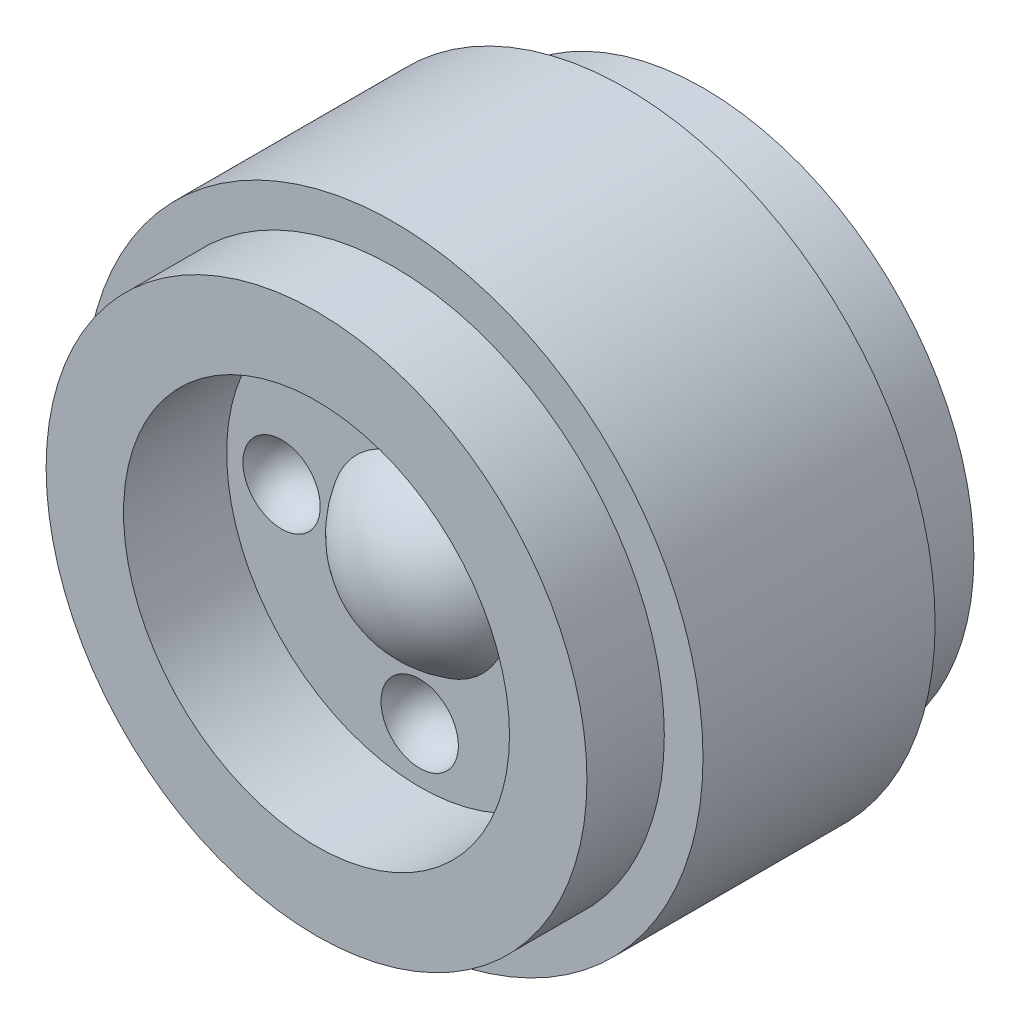
ISO-10303-21;
HEADER;
FILE_DESCRIPTION(('STEP AP214'),'2;1');
FILE_NAME('part.step','',(''),(''),'','','');
FILE_SCHEMA(('AUTOMOTIVE_DESIGN { 1 0 10303 214 1 1 1 1 }'));
ENDSEC;
DATA;
#1=APPLICATION_CONTEXT('core data for automotive mechanical design processes');
#2=APPLICATION_PROTOCOL_DEFINITION('international standard','automotive_design',2000,#1);
#3=PRODUCT_CONTEXT('',#1,'mechanical');
#4=PRODUCT('Part','Part','',(#3));
#5=PRODUCT_RELATED_PRODUCT_CATEGORY('part','',(#4));
#6=PRODUCT_DEFINITION_FORMATION('','',#4);
#7=PRODUCT_DEFINITION_CONTEXT('part definition',#1,'design');
#8=PRODUCT_DEFINITION('design','',#6,#7);
#9=PRODUCT_DEFINITION_SHAPE('','',#8);
#10=(LENGTH_UNIT() NAMED_UNIT(*) SI_UNIT(.MILLI.,.METRE.));
#11=(NAMED_UNIT(*) PLANE_ANGLE_UNIT() SI_UNIT($,.RADIAN.));
#12=(NAMED_UNIT(*) SI_UNIT($,.STERADIAN.) SOLID_ANGLE_UNIT());
#13=UNCERTAINTY_MEASURE_WITH_UNIT(LENGTH_MEASURE(1.E-05),#10,'distance_accuracy_value','');
#14=(GEOMETRIC_REPRESENTATION_CONTEXT(3) GLOBAL_UNCERTAINTY_ASSIGNED_CONTEXT((#13)) GLOBAL_UNIT_ASSIGNED_CONTEXT((#10,
#11,#12)) REPRESENTATION_CONTEXT('',''));
#15=CARTESIAN_POINT('',(0.,0.,0.));
#16=DIRECTION('',(0.,0.,1.));
#17=DIRECTION('',(1.,0.,0.));
#18=AXIS2_PLACEMENT_3D('',#15,#16,#17);
#19=CARTESIAN_POINT('',(0.,6.03504,2.82448));
#20=DIRECTION('',(0.,0.,-1.));
#21=DIRECTION('',(-1.,0.,0.));
#22=AXIS2_PLACEMENT_3D('',#19,#20,#21);
#23=PLANE('',#22);
#24=CARTESIAN_POINT('',(0.,-4.318,2.82448));
#25=DIRECTION('',(0.,0.,-1.));
#26=DIRECTION('',(-1.,0.,0.));
#27=AXIS2_PLACEMENT_3D('',#24,#25,#26);
#28=CIRCLE('',#27,1.20904);
#29=CARTESIAN_POINT('',(-1.20904,-4.318,2.82448));
#30=VERTEX_POINT('',#29);
#31=EDGE_CURVE('E53',#30,#30,#28,.F.);
#32=ORIENTED_EDGE('',*,*,#31,.F.);
#33=EDGE_LOOP('',(#32));
#34=FACE_BOUND('',#33,.T.);
#35=CARTESIAN_POINT('',(0.,4.318,2.82448));
#36=DIRECTION('',(0.,0.,-1.));
#37=DIRECTION('',(-1.,0.,0.));
#38=AXIS2_PLACEMENT_3D('',#35,#36,#37);
#39=CIRCLE('',#38,1.20904);
#40=CARTESIAN_POINT('',(-1.20904,4.318,2.82448));
#41=VERTEX_POINT('',#40);
#42=EDGE_CURVE('E47',#41,#41,#39,.F.);
#43=ORIENTED_EDGE('',*,*,#42,.F.);
#44=EDGE_LOOP('',(#43));
#45=FACE_BOUND('',#44,.T.);
#46=CARTESIAN_POINT('',(0.,0.,2.82448));
#47=DIRECTION('',(0.,0.,1.));
#48=DIRECTION('',(1.,0.,0.));
#49=AXIS2_PLACEMENT_3D('',#46,#47,#48);
#50=CIRCLE('',#49,2.79215673743434);
#51=CARTESIAN_POINT('',(2.79215673743434,0.,2.82448));
#52=VERTEX_POINT('',#51);
#53=EDGE_CURVE('E50',#52,#52,#50,.T.);
#54=ORIENTED_EDGE('',*,*,#53,.F.);
#55=EDGE_LOOP('',(#54));
#56=FACE_BOUND('',#55,.T.);
#57=CARTESIAN_POINT('',(0.,0.,2.82448));
#58=DIRECTION('',(0.,0.,1.));
#59=DIRECTION('',(1.,0.,0.));
#60=AXIS2_PLACEMENT_3D('',#57,#58,#59);
#61=CIRCLE('',#60,6.03504);
#62=CARTESIAN_POINT('',(6.03504,0.,2.82448));
#63=VERTEX_POINT('',#62);
#64=EDGE_CURVE('E225',#63,#63,#61,.T.);
#65=ORIENTED_EDGE('',*,*,#64,.T.);
#66=EDGE_LOOP('',(#65));
#67=FACE_BOUND('',#66,.T.);
#68=CARTESIAN_POINT('',(-4.318,0.,2.82448));
#69=DIRECTION('',(0.,0.,-1.));
#70=DIRECTION('',(-1.,0.,0.));
#71=AXIS2_PLACEMENT_3D('',#68,#69,#70);
#72=CIRCLE('',#71,1.20904);
#73=CARTESIAN_POINT('',(-5.52704,0.,2.82448));
#74=VERTEX_POINT('',#73);
#75=EDGE_CURVE('E51',#74,#74,#72,.F.);
#76=ORIENTED_EDGE('',*,*,#75,.F.);
#77=EDGE_LOOP('',(#76));
#78=FACE_BOUND('',#77,.T.);
#79=CARTESIAN_POINT('',(4.318,0.,2.82448));
#80=DIRECTION('',(0.,0.,-1.));
#81=DIRECTION('',(-1.,0.,0.));
#82=AXIS2_PLACEMENT_3D('',#79,#80,#81);
#83=CIRCLE('',#82,1.20904);
#84=CARTESIAN_POINT('',(3.10896,0.,2.82448));
#85=VERTEX_POINT('',#84);
#86=EDGE_CURVE('E34',#85,#85,#83,.F.);
#87=ORIENTED_EDGE('',*,*,#86,.F.);
#88=EDGE_LOOP('',(#87));
#89=FACE_BOUND('',#88,.T.);
#90=ADVANCED_FACE('F30',(#34,#45,#56,#67,#78,#89),#23,.F.);
#91=CARTESIAN_POINT('',(0.,0.,1.20904));
#92=DIRECTION('',(0.,0.,1.));
#93=DIRECTION('',(0.,1.,0.));
#94=AXIS2_PLACEMENT_3D('',#91,#92,#93);
#95=SPHERICAL_SURFACE('',#94,3.2258);
#96=ORIENTED_EDGE('',*,*,#53,.T.);
#97=EDGE_LOOP('',(#96));
#98=FACE_BOUND('',#97,.T.);
#99=ADVANCED_FACE('F32',(#98),#95,.T.);
#100=CARTESIAN_POINT('',(0.,3.2258,-1.61544));
#101=DIRECTION('',(0.,0.,1.));
#102=DIRECTION('',(1.,0.,0.));
#103=AXIS2_PLACEMENT_3D('',#100,#101,#102);
#104=PLANE('',#103);
#105=CARTESIAN_POINT('',(0.,0.,-1.61544));
#106=DIRECTION('',(0.,0.,1.));
#107=DIRECTION('',(1.,0.,0.));
#108=AXIS2_PLACEMENT_3D('',#105,#106,#107);
#109=CIRCLE('',#108,3.2258);
#110=CARTESIAN_POINT('',(3.2258,0.,-1.61544));
#111=VERTEX_POINT('',#110);
#112=EDGE_CURVE('E10',#111,#111,#109,.T.);
#113=ORIENTED_EDGE('',*,*,#112,.F.);
#114=EDGE_LOOP('',(#113));
#115=FACE_BOUND('',#114,.T.);
#116=ADVANCED_FACE('F68',(#115),#104,.F.);
#117=CARTESIAN_POINT('',(0.,0.,4.43484));
#118=DIRECTION('',(0.,0.,1.));
#119=DIRECTION('',(1.,0.,0.));
#120=AXIS2_PLACEMENT_3D('',#117,#118,#119);
#121=CYLINDRICAL_SURFACE('',#120,3.2258);
#122=CARTESIAN_POINT('',(0.,0.,-6.05028));
#123=DIRECTION('',(0.,0.,1.));
#124=DIRECTION('',(1.,0.,0.));
#125=AXIS2_PLACEMENT_3D('',#122,#123,#124);
#126=CIRCLE('',#125,3.2258);
#127=CARTESIAN_POINT('',(3.2258,0.,-6.05028));
#128=VERTEX_POINT('',#127);
#129=EDGE_CURVE('E38',#128,#128,#126,.T.);
#130=ORIENTED_EDGE('',*,*,#129,.F.);
#131=EDGE_LOOP('',(#130));
#132=FACE_BOUND('',#131,.T.);
#133=ORIENTED_EDGE('',*,*,#112,.T.);
#134=EDGE_LOOP('',(#133));
#135=FACE_BOUND('',#134,.T.);
#136=ADVANCED_FACE('F106',(#132,#135),#121,.F.);
#137=CARTESIAN_POINT('',(0.,3.2258,-6.05028));
#138=DIRECTION('',(0.,0.,1.));
#139=DIRECTION('',(1.,0.,0.));
#140=AXIS2_PLACEMENT_3D('',#137,#138,#139);
#141=PLANE('',#140);
#142=CARTESIAN_POINT('',(0.,0.,-6.05028));
#143=DIRECTION('',(0.,0.,1.));
#144=DIRECTION('',(1.,0.,0.));
#145=AXIS2_PLACEMENT_3D('',#142,#143,#144);
#146=CIRCLE('',#145,8.45566);
#147=CARTESIAN_POINT('',(8.45566,0.,-6.05028));
#148=VERTEX_POINT('',#147);
#149=EDGE_CURVE('E43',#148,#148,#146,.T.);
#150=ORIENTED_EDGE('',*,*,#149,.F.);
#151=EDGE_LOOP('',(#150));
#152=FACE_BOUND('',#151,.T.);
#153=ORIENTED_EDGE('',*,*,#129,.T.);
#154=EDGE_LOOP('',(#153));
#155=FACE_BOUND('',#154,.T.);
#156=ADVANCED_FACE('F102',(#152,#155),#141,.F.);
#157=CARTESIAN_POINT('',(0.,0.,4.43484));
#158=DIRECTION('',(0.,0.,1.));
#159=DIRECTION('',(1.,0.,0.));
#160=AXIS2_PLACEMENT_3D('',#157,#158,#159);
#161=CYLINDRICAL_SURFACE('',#160,8.45566);
#162=CARTESIAN_POINT('',(0.,0.,-3.62966));
#163=DIRECTION('',(0.,0.,1.));
#164=DIRECTION('',(1.,0.,0.));
#165=AXIS2_PLACEMENT_3D('',#162,#163,#164);
#166=CIRCLE('',#165,8.45566);
#167=CARTESIAN_POINT('',(8.45566,0.,-3.62966));
#168=VERTEX_POINT('',#167);
#169=EDGE_CURVE('E244',#168,#168,#166,.T.);
#170=ORIENTED_EDGE('',*,*,#169,.F.);
#171=EDGE_LOOP('',(#170));
#172=FACE_BOUND('',#171,.T.);
#173=ORIENTED_EDGE('',*,*,#149,.T.);
#174=EDGE_LOOP('',(#173));
#175=FACE_BOUND('',#174,.T.);
#176=ADVANCED_FACE('F98',(#172,#175),#161,.T.);
#177=CARTESIAN_POINT('',(0.,9.6647,-3.62966));
#178=DIRECTION('',(0.,0.,1.));
#179=DIRECTION('',(1.,0.,0.));
#180=AXIS2_PLACEMENT_3D('',#177,#178,#179);
#181=PLANE('',#180);
#182=CARTESIAN_POINT('',(0.,0.,-3.62966));
#183=DIRECTION('',(0.,0.,1.));
#184=DIRECTION('',(1.,0.,0.));
#185=AXIS2_PLACEMENT_3D('',#182,#183,#184);
#186=CIRCLE('',#185,9.6647);
#187=CARTESIAN_POINT('',(9.6647,0.,-3.62966));
#188=VERTEX_POINT('',#187);
#189=EDGE_CURVE('E241',#188,#188,#186,.T.);
#190=ORIENTED_EDGE('',*,*,#189,.F.);
#191=EDGE_LOOP('',(#190));
#192=FACE_BOUND('',#191,.T.);
#193=ORIENTED_EDGE('',*,*,#169,.T.);
#194=EDGE_LOOP('',(#193));
#195=FACE_BOUND('',#194,.T.);
#196=ADVANCED_FACE('F94',(#192,#195),#181,.F.);
#197=CARTESIAN_POINT('',(0.,0.,4.43484));
#198=DIRECTION('',(0.,0.,1.));
#199=DIRECTION('',(1.,0.,0.));
#200=AXIS2_PLACEMENT_3D('',#197,#198,#199);
#201=CYLINDRICAL_SURFACE('',#200,9.6647);
#202=CARTESIAN_POINT('',(0.,0.,3.62966));
#203=DIRECTION('',(0.,0.,1.));
#204=DIRECTION('',(1.,0.,0.));
#205=AXIS2_PLACEMENT_3D('',#202,#203,#204);
#206=CIRCLE('',#205,9.6647);
#207=CARTESIAN_POINT('',(9.6647,0.,3.62966));
#208=VERTEX_POINT('',#207);
#209=EDGE_CURVE('E238',#208,#208,#206,.T.);
#210=ORIENTED_EDGE('',*,*,#209,.F.);
#211=EDGE_LOOP('',(#210));
#212=FACE_BOUND('',#211,.T.);
#213=ORIENTED_EDGE('',*,*,#189,.T.);
#214=EDGE_LOOP('',(#213));
#215=FACE_BOUND('',#214,.T.);
#216=ADVANCED_FACE('F90',(#212,#215),#201,.T.);
#217=CARTESIAN_POINT('',(0.,9.6647,3.62966));
#218=DIRECTION('',(0.,0.,-1.));
#219=DIRECTION('',(-1.,0.,0.));
#220=AXIS2_PLACEMENT_3D('',#217,#218,#219);
#221=PLANE('',#220);
#222=CARTESIAN_POINT('',(0.,0.,3.62966));
#223=DIRECTION('',(0.,0.,1.));
#224=DIRECTION('',(1.,0.,0.));
#225=AXIS2_PLACEMENT_3D('',#222,#223,#224);
#226=CIRCLE('',#225,8.45566);
#227=CARTESIAN_POINT('',(8.45566,0.,3.62966));
#228=VERTEX_POINT('',#227);
#229=EDGE_CURVE('E235',#228,#228,#226,.T.);
#230=ORIENTED_EDGE('',*,*,#229,.F.);
#231=EDGE_LOOP('',(#230));
#232=FACE_BOUND('',#231,.T.);
#233=ORIENTED_EDGE('',*,*,#209,.T.);
#234=EDGE_LOOP('',(#233));
#235=FACE_BOUND('',#234,.T.);
#236=ADVANCED_FACE('F86',(#232,#235),#221,.F.);
#237=CARTESIAN_POINT('',(0.,0.,4.43484));
#238=DIRECTION('',(0.,0.,1.));
#239=DIRECTION('',(1.,0.,0.));
#240=AXIS2_PLACEMENT_3D('',#237,#238,#239);
#241=CYLINDRICAL_SURFACE('',#240,8.45566);
#242=CARTESIAN_POINT('',(0.,0.,6.05028));
#243=DIRECTION('',(0.,0.,1.));
#244=DIRECTION('',(1.,0.,0.));
#245=AXIS2_PLACEMENT_3D('',#242,#243,#244);
#246=CIRCLE('',#245,8.45566);
#247=CARTESIAN_POINT('',(8.45566,0.,6.05028));
#248=VERTEX_POINT('',#247);
#249=EDGE_CURVE('E229',#248,#248,#246,.T.);
#250=ORIENTED_EDGE('',*,*,#249,.F.);
#251=EDGE_LOOP('',(#250));
#252=FACE_BOUND('',#251,.T.);
#253=ORIENTED_EDGE('',*,*,#229,.T.);
#254=EDGE_LOOP('',(#253));
#255=FACE_BOUND('',#254,.T.);
#256=ADVANCED_FACE('F82',(#252,#255),#241,.T.);
#257=CARTESIAN_POINT('',(0.,8.45566,6.05028));
#258=DIRECTION('',(0.,0.,-1.));
#259=DIRECTION('',(-1.,0.,0.));
#260=AXIS2_PLACEMENT_3D('',#257,#258,#259);
#261=PLANE('',#260);
#262=CARTESIAN_POINT('',(0.,0.,6.05028));
#263=DIRECTION('',(0.,0.,1.));
#264=DIRECTION('',(1.,0.,0.));
#265=AXIS2_PLACEMENT_3D('',#262,#263,#264);
#266=CIRCLE('',#265,6.03504);
#267=CARTESIAN_POINT('',(6.03504,0.,6.05028));
#268=VERTEX_POINT('',#267);
#269=EDGE_CURVE('E226',#268,#268,#266,.T.);
#270=ORIENTED_EDGE('',*,*,#269,.F.);
#271=EDGE_LOOP('',(#270));
#272=FACE_BOUND('',#271,.T.);
#273=ORIENTED_EDGE('',*,*,#249,.T.);
#274=EDGE_LOOP('',(#273));
#275=FACE_BOUND('',#274,.T.);
#276=ADVANCED_FACE('F78',(#272,#275),#261,.F.);
#277=CARTESIAN_POINT('',(0.,0.,4.43484));
#278=DIRECTION('',(0.,0.,1.));
#279=DIRECTION('',(1.,0.,0.));
#280=AXIS2_PLACEMENT_3D('',#277,#278,#279);
#281=CYLINDRICAL_SURFACE('',#280,6.03504);
#282=ORIENTED_EDGE('',*,*,#64,.F.);
#283=EDGE_LOOP('',(#282));
#284=FACE_BOUND('',#283,.T.);
#285=ORIENTED_EDGE('',*,*,#269,.T.);
#286=EDGE_LOOP('',(#285));
#287=FACE_BOUND('',#286,.T.);
#288=ADVANCED_FACE('F75',(#284,#287),#281,.F.);
#289=CARTESIAN_POINT('',(0.,4.318,2.82448));
#290=DIRECTION('',(-1.,0.,0.));
#291=DIRECTION('',(0.,1.,0.));
#292=AXIS2_PLACEMENT_3D('',#289,#290,#291);
#293=SPHERICAL_SURFACE('',#292,1.20904);
#294=CARTESIAN_POINT('',(0.,4.318,2.82448));
#295=DIRECTION('',(0.,0.,-1.));
#296=DIRECTION('',(-1.,0.,0.));
#297=AXIS2_PLACEMENT_3D('',#294,#295,#296);
#298=SPHERICAL_SURFACE('',#297,1.20904);
#299=ORIENTED_EDGE('',*,*,#42,.T.);
#300=EDGE_LOOP('',(#299));
#301=FACE_BOUND('',#300,.T.);
#302=ADVANCED_FACE('F73',(#301),#298,.F.);
#303=CARTESIAN_POINT('',(-4.318,0.,2.82448));
#304=DIRECTION('',(0.,-1.,0.));
#305=DIRECTION('',(-1.,0.,0.));
#306=AXIS2_PLACEMENT_3D('',#303,#304,#305);
#307=SPHERICAL_SURFACE('',#306,1.20904);
#308=CARTESIAN_POINT('',(-4.318,0.,2.82448));
#309=DIRECTION('',(0.,0.,-1.));
#310=DIRECTION('',(-1.,0.,0.));
#311=AXIS2_PLACEMENT_3D('',#308,#309,#310);
#312=SPHERICAL_SURFACE('',#311,1.20904);
#313=ORIENTED_EDGE('',*,*,#75,.T.);
#314=EDGE_LOOP('',(#313));
#315=FACE_BOUND('',#314,.T.);
#316=ADVANCED_FACE('F158',(#315),#312,.F.);
#317=CARTESIAN_POINT('',(0.,-4.318,2.82448));
#318=DIRECTION('',(1.,0.,0.));
#319=DIRECTION('',(0.,-1.,0.));
#320=AXIS2_PLACEMENT_3D('',#317,#318,#319);
#321=SPHERICAL_SURFACE('',#320,1.20904);
#322=CARTESIAN_POINT('',(0.,-4.318,2.82448));
#323=DIRECTION('',(0.,0.,-1.));
#324=DIRECTION('',(-1.,0.,0.));
#325=AXIS2_PLACEMENT_3D('',#322,#323,#324);
#326=SPHERICAL_SURFACE('',#325,1.20904);
#327=ORIENTED_EDGE('',*,*,#31,.T.);
#328=EDGE_LOOP('',(#327));
#329=FACE_BOUND('',#328,.T.);
#330=ADVANCED_FACE('F165',(#329),#326,.F.);
#331=CARTESIAN_POINT('',(4.318,0.,2.82448));
#332=DIRECTION('',(0.,1.,0.));
#333=DIRECTION('',(1.,0.,0.));
#334=AXIS2_PLACEMENT_3D('',#331,#332,#333);
#335=SPHERICAL_SURFACE('',#334,1.20904);
#336=CARTESIAN_POINT('',(4.318,0.,2.82448));
#337=DIRECTION('',(0.,0.,-1.));
#338=DIRECTION('',(-1.,0.,0.));
#339=AXIS2_PLACEMENT_3D('',#336,#337,#338);
#340=SPHERICAL_SURFACE('',#339,1.20904);
#341=ORIENTED_EDGE('',*,*,#86,.T.);
#342=EDGE_LOOP('',(#341));
#343=FACE_BOUND('',#342,.T.);
#344=ADVANCED_FACE('F60',(#343),#340,.F.);
#345=CLOSED_SHELL('',(#90,#99,#116,#136,#156,#176,#196,#216,#236,#256,#276,#288,#302,#316,#330,#344));
#346=MANIFOLD_SOLID_BREP('B2',#345);
#347=ADVANCED_BREP_SHAPE_REPRESENTATION('',(#18,#346),#14);
#348=SHAPE_DEFINITION_REPRESENTATION(#9,#347);
ENDSEC;
END-ISO-10303-21;
